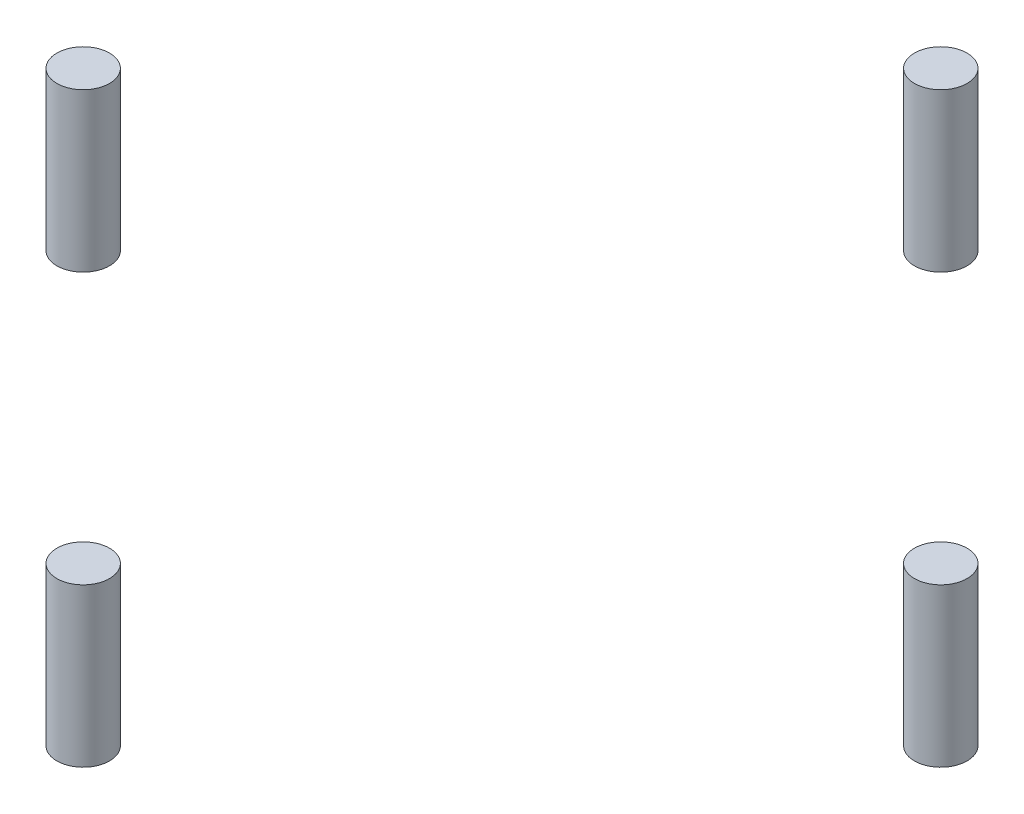
ISO-10303-21;
HEADER;
FILE_DESCRIPTION(('STEP AP214'),'2;1');
FILE_NAME('part.step','',(''),(''),'','','');
FILE_SCHEMA(('AUTOMOTIVE_DESIGN { 1 0 10303 214 1 1 1 1 }'));
ENDSEC;
DATA;
#1=APPLICATION_CONTEXT('core data for automotive mechanical design processes');
#2=APPLICATION_PROTOCOL_DEFINITION('international standard','automotive_design',2000,#1);
#3=PRODUCT_CONTEXT('',#1,'mechanical');
#4=PRODUCT('Part','Part','',(#3));
#5=PRODUCT_RELATED_PRODUCT_CATEGORY('part','',(#4));
#6=PRODUCT_DEFINITION_FORMATION('','',#4);
#7=PRODUCT_DEFINITION_CONTEXT('part definition',#1,'design');
#8=PRODUCT_DEFINITION('design','',#6,#7);
#9=PRODUCT_DEFINITION_SHAPE('','',#8);
#10=(LENGTH_UNIT() NAMED_UNIT(*) SI_UNIT(.MILLI.,.METRE.));
#11=(NAMED_UNIT(*) PLANE_ANGLE_UNIT() SI_UNIT($,.RADIAN.));
#12=(NAMED_UNIT(*) SI_UNIT($,.STERADIAN.) SOLID_ANGLE_UNIT());
#13=UNCERTAINTY_MEASURE_WITH_UNIT(LENGTH_MEASURE(1.E-05),#10,'distance_accuracy_value','');
#14=(GEOMETRIC_REPRESENTATION_CONTEXT(3) GLOBAL_UNCERTAINTY_ASSIGNED_CONTEXT((#13)) GLOBAL_UNIT_ASSIGNED_CONTEXT((#10,
#11,#12)) REPRESENTATION_CONTEXT('',''));
#15=CARTESIAN_POINT('',(0.,0.,0.));
#16=DIRECTION('',(0.,0.,1.));
#17=DIRECTION('',(1.,0.,0.));
#18=AXIS2_PLACEMENT_3D('',#15,#16,#17);
#19=CARTESIAN_POINT('',(48.8528137423858,18.,0.));
#20=DIRECTION('',(0.,-1.,0.));
#21=DIRECTION('',(0.,0.,-1.));
#22=AXIS2_PLACEMENT_3D('',#19,#20,#21);
#23=CYLINDRICAL_SURFACE('',#22,3.);
#24=CARTESIAN_POINT('',(48.8528137423858,18.,0.));
#25=DIRECTION('',(0.,1.,0.));
#26=DIRECTION('',(0.,0.,1.));
#27=AXIS2_PLACEMENT_3D('',#24,#25,#26);
#28=CIRCLE('',#27,3.);
#29=CARTESIAN_POINT('',(48.8528137423858,18.,2.99999999999995));
#30=VERTEX_POINT('',#29);
#31=EDGE_CURVE('E52',#30,#30,#28,.T.);
#32=ORIENTED_EDGE('',*,*,#31,.F.);
#33=EDGE_LOOP('',(#32));
#34=FACE_BOUND('',#33,.T.);
#35=CARTESIAN_POINT('',(48.8528137423858,0.,0.));
#36=DIRECTION('',(0.,1.,0.));
#37=DIRECTION('',(0.,0.,1.));
#38=AXIS2_PLACEMENT_3D('',#35,#36,#37);
#39=CIRCLE('',#38,3.);
#40=CARTESIAN_POINT('',(48.8528137423858,0.,2.99999999999995));
#41=VERTEX_POINT('',#40);
#42=EDGE_CURVE('E11',#41,#41,#39,.T.);
#43=ORIENTED_EDGE('',*,*,#42,.T.);
#44=EDGE_LOOP('',(#43));
#45=FACE_BOUND('',#44,.T.);
#46=ADVANCED_FACE('F48',(#34,#45),#23,.T.);
#47=CARTESIAN_POINT('',(48.8528137423858,18.,0.));
#48=DIRECTION('',(0.,1.,0.));
#49=DIRECTION('',(0.,0.,1.));
#50=AXIS2_PLACEMENT_3D('',#47,#48,#49);
#51=PLANE('',#50);
#52=ORIENTED_EDGE('',*,*,#31,.T.);
#53=EDGE_LOOP('',(#52));
#54=FACE_BOUND('',#53,.T.);
#55=ADVANCED_FACE('F50',(#54),#51,.T.);
#56=CARTESIAN_POINT('',(48.8528137423858,0.,0.));
#57=DIRECTION('',(0.,1.,0.));
#58=DIRECTION('',(0.,0.,1.));
#59=AXIS2_PLACEMENT_3D('',#56,#57,#58);
#60=PLANE('',#59);
#61=ORIENTED_EDGE('',*,*,#42,.F.);
#62=EDGE_LOOP('',(#61));
#63=FACE_BOUND('',#62,.T.);
#64=ADVANCED_FACE('F69',(#63),#60,.F.);
#65=CLOSED_SHELL('',(#46,#55,#64));
#66=MANIFOLD_SOLID_BREP('B2',#65);
#67=CARTESIAN_POINT('',(0.,18.,48.852813742385));
#68=DIRECTION('',(0.,-1.,0.));
#69=DIRECTION('',(0.,0.,-1.));
#70=AXIS2_PLACEMENT_3D('',#67,#68,#69);
#71=CYLINDRICAL_SURFACE('',#70,2.999961644394);
#72=CARTESIAN_POINT('',(0.,18.,48.852813742385));
#73=DIRECTION('',(0.,1.,0.));
#74=DIRECTION('',(0.,0.,1.));
#75=AXIS2_PLACEMENT_3D('',#72,#73,#74);
#76=CIRCLE('',#75,2.999961644394);
#77=CARTESIAN_POINT('',(0.,18.,51.852775386779));
#78=VERTEX_POINT('',#77);
#79=EDGE_CURVE('E103',#78,#78,#76,.T.);
#80=ORIENTED_EDGE('',*,*,#79,.F.);
#81=EDGE_LOOP('',(#80));
#82=FACE_BOUND('',#81,.T.);
#83=CARTESIAN_POINT('',(0.,0.,48.852813742385));
#84=DIRECTION('',(0.,1.,0.));
#85=DIRECTION('',(0.,0.,1.));
#86=AXIS2_PLACEMENT_3D('',#83,#84,#85);
#87=CIRCLE('',#86,2.999961644394);
#88=CARTESIAN_POINT('',(0.,0.,51.852775386779));
#89=VERTEX_POINT('',#88);
#90=EDGE_CURVE('E47',#89,#89,#87,.T.);
#91=ORIENTED_EDGE('',*,*,#90,.T.);
#92=EDGE_LOOP('',(#91));
#93=FACE_BOUND('',#92,.T.);
#94=ADVANCED_FACE('F99',(#82,#93),#71,.T.);
#95=CARTESIAN_POINT('',(0.,18.,48.852813742385));
#96=DIRECTION('',(0.,1.,0.));
#97=DIRECTION('',(0.,0.,1.));
#98=AXIS2_PLACEMENT_3D('',#95,#96,#97);
#99=PLANE('',#98);
#100=ORIENTED_EDGE('',*,*,#79,.T.);
#101=EDGE_LOOP('',(#100));
#102=FACE_BOUND('',#101,.T.);
#103=ADVANCED_FACE('F101',(#102),#99,.T.);
#104=CARTESIAN_POINT('',(0.,0.,48.852813742385));
#105=DIRECTION('',(0.,1.,0.));
#106=DIRECTION('',(0.,0.,1.));
#107=AXIS2_PLACEMENT_3D('',#104,#105,#106);
#108=PLANE('',#107);
#109=ORIENTED_EDGE('',*,*,#90,.F.);
#110=EDGE_LOOP('',(#109));
#111=FACE_BOUND('',#110,.T.);
#112=ADVANCED_FACE('F118',(#111),#108,.F.);
#113=CLOSED_SHELL('',(#94,#103,#112));
#114=MANIFOLD_SOLID_BREP('B6',#113);
#115=CARTESIAN_POINT('',(0.,18.,-48.852813742385));
#116=DIRECTION('',(0.,-1.,0.));
#117=DIRECTION('',(0.,0.,-1.));
#118=AXIS2_PLACEMENT_3D('',#115,#116,#117);
#119=CYLINDRICAL_SURFACE('',#118,2.999961644394);
#120=CARTESIAN_POINT('',(0.,18.,-48.852813742385));
#121=DIRECTION('',(0.,1.,0.));
#122=DIRECTION('',(0.,0.,1.));
#123=AXIS2_PLACEMENT_3D('',#120,#121,#122);
#124=CIRCLE('',#123,2.999961644394);
#125=CARTESIAN_POINT('',(0.,18.,-45.852852097991));
#126=VERTEX_POINT('',#125);
#127=EDGE_CURVE('E151',#126,#126,#124,.T.);
#128=ORIENTED_EDGE('',*,*,#127,.F.);
#129=EDGE_LOOP('',(#128));
#130=FACE_BOUND('',#129,.T.);
#131=CARTESIAN_POINT('',(0.,0.,-48.852813742385));
#132=DIRECTION('',(0.,1.,0.));
#133=DIRECTION('',(0.,0.,1.));
#134=AXIS2_PLACEMENT_3D('',#131,#132,#133);
#135=CIRCLE('',#134,2.999961644394);
#136=CARTESIAN_POINT('',(0.,0.,-45.852852097991));
#137=VERTEX_POINT('',#136);
#138=EDGE_CURVE('E98',#137,#137,#135,.T.);
#139=ORIENTED_EDGE('',*,*,#138,.T.);
#140=EDGE_LOOP('',(#139));
#141=FACE_BOUND('',#140,.T.);
#142=ADVANCED_FACE('F147',(#130,#141),#119,.T.);
#143=CARTESIAN_POINT('',(0.,18.,-48.852813742385));
#144=DIRECTION('',(0.,1.,0.));
#145=DIRECTION('',(0.,0.,1.));
#146=AXIS2_PLACEMENT_3D('',#143,#144,#145);
#147=PLANE('',#146);
#148=ORIENTED_EDGE('',*,*,#127,.T.);
#149=EDGE_LOOP('',(#148));
#150=FACE_BOUND('',#149,.T.);
#151=ADVANCED_FACE('F149',(#150),#147,.T.);
#152=CARTESIAN_POINT('',(0.,0.,-48.852813742385));
#153=DIRECTION('',(0.,1.,0.));
#154=DIRECTION('',(0.,0.,1.));
#155=AXIS2_PLACEMENT_3D('',#152,#153,#154);
#156=PLANE('',#155);
#157=ORIENTED_EDGE('',*,*,#138,.F.);
#158=EDGE_LOOP('',(#157));
#159=FACE_BOUND('',#158,.T.);
#160=ADVANCED_FACE('F166',(#159),#156,.F.);
#161=CLOSED_SHELL('',(#142,#151,#160));
#162=MANIFOLD_SOLID_BREP('B42',#161);
#163=CARTESIAN_POINT('',(-48.8528137423858,18.,0.));
#164=DIRECTION('',(0.,-1.,0.));
#165=DIRECTION('',(0.,0.,-1.));
#166=AXIS2_PLACEMENT_3D('',#163,#164,#165);
#167=CYLINDRICAL_SURFACE('',#166,3.);
#168=CARTESIAN_POINT('',(-48.8528137423858,18.,0.));
#169=DIRECTION('',(0.,1.,0.));
#170=DIRECTION('',(0.,0.,1.));
#171=AXIS2_PLACEMENT_3D('',#168,#169,#170);
#172=CIRCLE('',#171,3.);
#173=CARTESIAN_POINT('',(-48.8528137423858,18.,2.99999999999995));
#174=VERTEX_POINT('',#173);
#175=EDGE_CURVE('E146',#174,#174,#172,.F.);
#176=ORIENTED_EDGE('',*,*,#175,.T.);
#177=EDGE_LOOP('',(#176));
#178=FACE_BOUND('',#177,.T.);
#179=CARTESIAN_POINT('',(-48.8528137423858,0.,0.));
#180=DIRECTION('',(0.,1.,0.));
#181=DIRECTION('',(0.,0.,1.));
#182=AXIS2_PLACEMENT_3D('',#179,#180,#181);
#183=CIRCLE('',#182,3.);
#184=CARTESIAN_POINT('',(-48.8528137423858,0.,2.99999999999995));
#185=VERTEX_POINT('',#184);
#186=EDGE_CURVE('E191',#185,#185,#183,.F.);
#187=ORIENTED_EDGE('',*,*,#186,.F.);
#188=EDGE_LOOP('',(#187));
#189=FACE_BOUND('',#188,.T.);
#190=ADVANCED_FACE('F188',(#178,#189),#167,.T.);
#191=CARTESIAN_POINT('',(0.,18.,0.));
#192=DIRECTION('',(0.,1.,0.));
#193=DIRECTION('',(0.,0.,1.));
#194=AXIS2_PLACEMENT_3D('',#191,#192,#193);
#195=PLANE('',#194);
#196=ORIENTED_EDGE('',*,*,#175,.F.);
#197=EDGE_LOOP('',(#196));
#198=FACE_BOUND('',#197,.T.);
#199=ADVANCED_FACE('F203',(#198),#195,.T.);
#200=CARTESIAN_POINT('',(0.,0.,0.));
#201=DIRECTION('',(0.,1.,0.));
#202=DIRECTION('',(0.,0.,1.));
#203=AXIS2_PLACEMENT_3D('',#200,#201,#202);
#204=PLANE('',#203);
#205=ORIENTED_EDGE('',*,*,#186,.T.);
#206=EDGE_LOOP('',(#205));
#207=FACE_BOUND('',#206,.T.);
#208=ADVANCED_FACE('F200',(#207),#204,.F.);
#209=CLOSED_SHELL('',(#190,#199,#208));
#210=MANIFOLD_SOLID_BREP('B93',#209);
#211=ADVANCED_BREP_SHAPE_REPRESENTATION('',(#18,#66,#114,#162,#210),#14);
#212=SHAPE_DEFINITION_REPRESENTATION(#9,#211);
ENDSEC;
END-ISO-10303-21;
